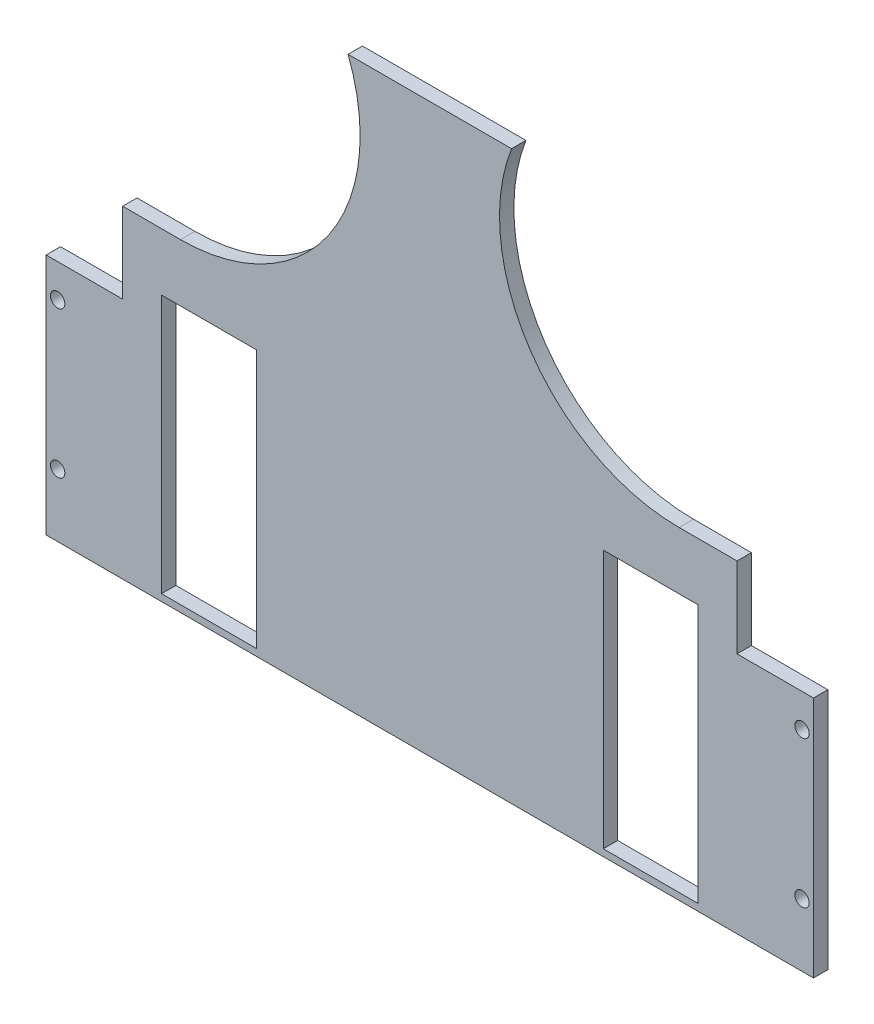
ISO-10303-21;
HEADER;
FILE_DESCRIPTION(('STEP AP214'),'2;1');
FILE_NAME('part.step','',(''),(''),'','','');
FILE_SCHEMA(('AUTOMOTIVE_DESIGN { 1 0 10303 214 1 1 1 1 }'));
ENDSEC;
DATA;
#1=APPLICATION_CONTEXT('core data for automotive mechanical design processes');
#2=APPLICATION_PROTOCOL_DEFINITION('international standard','automotive_design',2000,#1);
#3=PRODUCT_CONTEXT('',#1,'mechanical');
#4=PRODUCT('Part','Part','',(#3));
#5=PRODUCT_RELATED_PRODUCT_CATEGORY('part','',(#4));
#6=PRODUCT_DEFINITION_FORMATION('','',#4);
#7=PRODUCT_DEFINITION_CONTEXT('part definition',#1,'design');
#8=PRODUCT_DEFINITION('design','',#6,#7);
#9=PRODUCT_DEFINITION_SHAPE('','',#8);
#10=(LENGTH_UNIT() NAMED_UNIT(*) SI_UNIT(.MILLI.,.METRE.));
#11=(NAMED_UNIT(*) PLANE_ANGLE_UNIT() SI_UNIT($,.RADIAN.));
#12=(NAMED_UNIT(*) SI_UNIT($,.STERADIAN.) SOLID_ANGLE_UNIT());
#13=UNCERTAINTY_MEASURE_WITH_UNIT(LENGTH_MEASURE(1.E-05),#10,'distance_accuracy_value','');
#14=(GEOMETRIC_REPRESENTATION_CONTEXT(3) GLOBAL_UNCERTAINTY_ASSIGNED_CONTEXT((#13)) GLOBAL_UNIT_ASSIGNED_CONTEXT((#10,
#11,#12)) REPRESENTATION_CONTEXT('',''));
#15=CARTESIAN_POINT('',(0.,0.,0.));
#16=DIRECTION('',(0.,0.,1.));
#17=DIRECTION('',(1.,0.,0.));
#18=AXIS2_PLACEMENT_3D('',#15,#16,#17);
#19=CARTESIAN_POINT('',(0.,0.,5.));
#20=DIRECTION('',(0.,0.,1.));
#21=DIRECTION('',(1.,0.,0.));
#22=AXIS2_PLACEMENT_3D('',#19,#20,#21);
#23=PLANE('',#22);
#24=DIRECTION('',(1.,0.,0.));
#25=VECTOR('',#24,1.);
#26=CARTESIAN_POINT('',(-1220.60000000002,-182.000000000016,5.));
#27=LINE('',#26,#25);
#28=CARTESIAN_POINT('',(-1220.60000000002,-182.000000000016,5.));
#29=VERTEX_POINT('',#28);
#30=CARTESIAN_POINT('',(-1193.99566164199,-182.000000000016,5.));
#31=VERTEX_POINT('',#30);
#32=EDGE_CURVE('E336',#29,#31,#27,.T.);
#33=ORIENTED_EDGE('',*,*,#32,.F.);
#34=DIRECTION('',(0.,-1.,0.));
#35=VECTOR('',#34,1.);
#36=CARTESIAN_POINT('',(-1220.60000000002,-69.0000000000159,5.));
#37=LINE('',#36,#35);
#38=CARTESIAN_POINT('',(-1220.60000000002,-266.375602835039,5.));
#39=VERTEX_POINT('',#38);
#40=EDGE_CURVE('E202',#29,#39,#37,.T.);
#41=ORIENTED_EDGE('',*,*,#40,.T.);
#42=DIRECTION('',(-1.,0.,0.));
#43=VECTOR('',#42,1.);
#44=CARTESIAN_POINT('',(-1220.60000000002,-266.375602835039,5.));
#45=LINE('',#44,#43);
#46=CARTESIAN_POINT('',(-953.600000000017,-266.375602835039,5.));
#47=VERTEX_POINT('',#46);
#48=EDGE_CURVE('E173',#47,#39,#45,.T.);
#49=ORIENTED_EDGE('',*,*,#48,.F.);
#50=DIRECTION('',(0.,1.,0.));
#51=VECTOR('',#50,1.);
#52=CARTESIAN_POINT('',(-953.600000000017,-69.0000000000159,5.));
#53=LINE('',#52,#51);
#54=CARTESIAN_POINT('',(-953.600000000017,-182.000000000016,5.));
#55=VERTEX_POINT('',#54);
#56=EDGE_CURVE('E42',#47,#55,#53,.T.);
#57=ORIENTED_EDGE('',*,*,#56,.T.);
#58=DIRECTION('',(1.,0.,0.));
#59=VECTOR('',#58,1.);
#60=CARTESIAN_POINT('',(-953.600000000017,-182.000000000016,5.));
#61=LINE('',#60,#59);
#62=CARTESIAN_POINT('',(-980.204338358043,-182.000000000016,5.));
#63=VERTEX_POINT('',#62);
#64=EDGE_CURVE('E298',#63,#55,#61,.T.);
#65=ORIENTED_EDGE('',*,*,#64,.F.);
#66=DIRECTION('',(0.,-1.,0.));
#67=VECTOR('',#66,1.);
#68=CARTESIAN_POINT('',(-980.204338358043,-182.000000000016,5.));
#69=LINE('',#68,#67);
#70=CARTESIAN_POINT('',(-980.204338358043,-154.000000000016,5.));
#71=VERTEX_POINT('',#70);
#72=EDGE_CURVE('E301',#71,#63,#69,.T.);
#73=ORIENTED_EDGE('',*,*,#72,.F.);
#74=DIRECTION('',(1.,0.,0.));
#75=VECTOR('',#74,1.);
#76=CARTESIAN_POINT('',(-980.204338358043,-154.000000000016,5.));
#77=LINE('',#76,#75);
#78=CARTESIAN_POINT('',(-1000.35039250811,-154.000000000016,5.));
#79=VERTEX_POINT('',#78);
#80=EDGE_CURVE('E304',#79,#71,#77,.T.);
#81=ORIENTED_EDGE('',*,*,#80,.F.);
#82=CARTESIAN_POINT('',(-1000.35039250811,-91.5000000000158,5.));
#83=DIRECTION('',(0.,0.,1.));
#84=DIRECTION('',(-1.,0.,0.));
#85=AXIS2_PLACEMENT_3D('',#82,#83,#84);
#86=CIRCLE('',#85,62.5);
#87=CARTESIAN_POINT('',(-1058.65991145656,-69.0000000000159,5.));
#88=VERTEX_POINT('',#87);
#89=EDGE_CURVE('E178',#88,#79,#86,.T.);
#90=ORIENTED_EDGE('',*,*,#89,.F.);
#91=DIRECTION('',(-1.,0.,0.));
#92=VECTOR('',#91,1.);
#93=CARTESIAN_POINT('',(-1220.60000000002,-69.0000000000159,5.));
#94=LINE('',#93,#92);
#95=CARTESIAN_POINT('',(-1115.54008854347,-69.0000000000159,5.));
#96=VERTEX_POINT('',#95);
#97=EDGE_CURVE('E11',#88,#96,#94,.T.);
#98=ORIENTED_EDGE('',*,*,#97,.T.);
#99=CARTESIAN_POINT('',(-1173.84960749192,-91.5000000000159,5.));
#100=DIRECTION('',(0.,0.,1.));
#101=DIRECTION('',(1.,0.,0.));
#102=AXIS2_PLACEMENT_3D('',#99,#100,#101);
#103=CIRCLE('',#102,62.5);
#104=CARTESIAN_POINT('',(-1173.84960749192,-154.000000000016,5.));
#105=VERTEX_POINT('',#104);
#106=EDGE_CURVE('E58',#105,#96,#103,.T.);
#107=ORIENTED_EDGE('',*,*,#106,.F.);
#108=DIRECTION('',(1.,0.,0.));
#109=VECTOR('',#108,1.);
#110=CARTESIAN_POINT('',(-1193.99566164199,-154.000000000016,5.));
#111=LINE('',#110,#109);
#112=CARTESIAN_POINT('',(-1193.99566164199,-154.000000000016,5.));
#113=VERTEX_POINT('',#112);
#114=EDGE_CURVE('E330',#113,#105,#111,.T.);
#115=ORIENTED_EDGE('',*,*,#114,.F.);
#116=DIRECTION('',(0.,1.,0.));
#117=VECTOR('',#116,1.);
#118=CARTESIAN_POINT('',(-1193.99566164199,-182.000000000016,5.));
#119=LINE('',#118,#117);
#120=EDGE_CURVE('E333',#31,#113,#119,.T.);
#121=ORIENTED_EDGE('',*,*,#120,.F.);
#122=EDGE_LOOP('',(#33,#41,#49,#57,#65,#73,#81,#90,#98,#107,#115,#121));
#123=FACE_BOUND('',#122,.T.);
#124=CARTESIAN_POINT('',(-1216.60000000002,-244.500000000016,5.));
#125=DIRECTION('',(0.,0.,1.));
#126=DIRECTION('',(-1.,0.,0.));
#127=AXIS2_PLACEMENT_3D('',#124,#125,#126);
#128=CIRCLE('',#127,2.49999999999991);
#129=CARTESIAN_POINT('',(-1219.10000000002,-244.500000000016,5.));
#130=VERTEX_POINT('',#129);
#131=EDGE_CURVE('E241',#130,#130,#128,.T.);
#132=ORIENTED_EDGE('',*,*,#131,.F.);
#133=EDGE_LOOP('',(#132));
#134=FACE_BOUND('',#133,.T.);
#135=CARTESIAN_POINT('',(-957.600000000017,-193.500000000016,5.));
#136=DIRECTION('',(0.,0.,1.));
#137=DIRECTION('',(1.,0.,0.));
#138=AXIS2_PLACEMENT_3D('',#135,#136,#137);
#139=CIRCLE('',#138,2.50000000000003);
#140=CARTESIAN_POINT('',(-955.100000000017,-193.500000000016,5.));
#141=VERTEX_POINT('',#140);
#142=EDGE_CURVE('E224',#141,#141,#139,.T.);
#143=ORIENTED_EDGE('',*,*,#142,.F.);
#144=EDGE_LOOP('',(#143));
#145=FACE_BOUND('',#144,.T.);
#146=DIRECTION('',(1.,0.,0.));
#147=VECTOR('',#146,1.);
#148=CARTESIAN_POINT('',(-1026.74000000002,-264.000000000016,5.));
#149=LINE('',#148,#147);
#150=CARTESIAN_POINT('',(-1026.74000000002,-264.000000000016,5.));
#151=VERTEX_POINT('',#150);
#152=CARTESIAN_POINT('',(-993.740000000017,-264.000000000016,5.));
#153=VERTEX_POINT('',#152);
#154=EDGE_CURVE('E229',#151,#153,#149,.T.);
#155=ORIENTED_EDGE('',*,*,#154,.F.);
#156=DIRECTION('',(0.,-1.,0.));
#157=VECTOR('',#156,1.);
#158=CARTESIAN_POINT('',(-1026.74000000002,-174.000000000016,5.));
#159=LINE('',#158,#157);
#160=CARTESIAN_POINT('',(-1026.74000000002,-174.000000000016,5.));
#161=VERTEX_POINT('',#160);
#162=EDGE_CURVE('E214',#161,#151,#159,.T.);
#163=ORIENTED_EDGE('',*,*,#162,.F.);
#164=DIRECTION('',(-1.,0.,0.));
#165=VECTOR('',#164,1.);
#166=CARTESIAN_POINT('',(-1026.74000000002,-174.000000000016,5.));
#167=LINE('',#166,#165);
#168=CARTESIAN_POINT('',(-993.740000000017,-174.000000000016,5.));
#169=VERTEX_POINT('',#168);
#170=EDGE_CURVE('E210',#169,#161,#167,.T.);
#171=ORIENTED_EDGE('',*,*,#170,.F.);
#172=DIRECTION('',(0.,1.,0.));
#173=VECTOR('',#172,1.);
#174=CARTESIAN_POINT('',(-993.740000000017,-174.000000000016,5.));
#175=LINE('',#174,#173);
#176=EDGE_CURVE('E226',#153,#169,#175,.T.);
#177=ORIENTED_EDGE('',*,*,#176,.F.);
#178=EDGE_LOOP('',(#155,#163,#171,#177));
#179=FACE_BOUND('',#178,.T.);
#180=CARTESIAN_POINT('',(-957.600000000017,-244.500000000016,5.));
#181=DIRECTION('',(0.,0.,1.));
#182=DIRECTION('',(1.,0.,0.));
#183=AXIS2_PLACEMENT_3D('',#180,#181,#182);
#184=CIRCLE('',#183,2.50000000000003);
#185=CARTESIAN_POINT('',(-955.100000000017,-244.500000000016,5.));
#186=VERTEX_POINT('',#185);
#187=EDGE_CURVE('E235',#186,#186,#184,.T.);
#188=ORIENTED_EDGE('',*,*,#187,.F.);
#189=EDGE_LOOP('',(#188));
#190=FACE_BOUND('',#189,.T.);
#191=CARTESIAN_POINT('',(-1216.60000000002,-193.500000000016,5.));
#192=DIRECTION('',(0.,0.,1.));
#193=DIRECTION('',(-1.,0.,0.));
#194=AXIS2_PLACEMENT_3D('',#191,#192,#193);
#195=CIRCLE('',#194,2.49999999999991);
#196=CARTESIAN_POINT('',(-1219.10000000002,-193.500000000016,5.));
#197=VERTEX_POINT('',#196);
#198=EDGE_CURVE('E247',#197,#197,#195,.T.);
#199=ORIENTED_EDGE('',*,*,#198,.F.);
#200=EDGE_LOOP('',(#199));
#201=FACE_BOUND('',#200,.T.);
#202=DIRECTION('',(0.,-1.,0.));
#203=VECTOR('',#202,1.);
#204=CARTESIAN_POINT('',(-1180.46000000002,-174.000000000016,5.));
#205=LINE('',#204,#203);
#206=CARTESIAN_POINT('',(-1180.46000000002,-174.000000000016,5.));
#207=VERTEX_POINT('',#206);
#208=CARTESIAN_POINT('',(-1180.46000000002,-264.000000000016,5.));
#209=VERTEX_POINT('',#208);
#210=EDGE_CURVE('E284',#207,#209,#205,.T.);
#211=ORIENTED_EDGE('',*,*,#210,.F.);
#212=DIRECTION('',(-1.,0.,0.));
#213=VECTOR('',#212,1.);
#214=CARTESIAN_POINT('',(-1147.46000000002,-174.000000000016,5.));
#215=LINE('',#214,#213);
#216=CARTESIAN_POINT('',(-1147.46000000002,-174.000000000016,5.));
#217=VERTEX_POINT('',#216);
#218=EDGE_CURVE('E269',#217,#207,#215,.T.);
#219=ORIENTED_EDGE('',*,*,#218,.F.);
#220=DIRECTION('',(0.,1.,0.));
#221=VECTOR('',#220,1.);
#222=CARTESIAN_POINT('',(-1147.46000000002,-174.000000000016,5.));
#223=LINE('',#222,#221);
#224=CARTESIAN_POINT('',(-1147.46000000002,-264.000000000016,5.));
#225=VERTEX_POINT('',#224);
#226=EDGE_CURVE('E265',#225,#217,#223,.T.);
#227=ORIENTED_EDGE('',*,*,#226,.F.);
#228=DIRECTION('',(1.,0.,0.));
#229=VECTOR('',#228,1.);
#230=CARTESIAN_POINT('',(-1147.46000000002,-264.000000000016,5.));
#231=LINE('',#230,#229);
#232=EDGE_CURVE('E281',#209,#225,#231,.T.);
#233=ORIENTED_EDGE('',*,*,#232,.F.);
#234=EDGE_LOOP('',(#211,#219,#227,#233));
#235=FACE_BOUND('',#234,.T.);
#236=ADVANCED_FACE('F33',(#123,#134,#145,#179,#190,#201,#235),#23,.T.);
#237=CARTESIAN_POINT('',(0.,0.,0.));
#238=DIRECTION('',(0.,0.,1.));
#239=DIRECTION('',(1.,0.,0.));
#240=AXIS2_PLACEMENT_3D('',#237,#238,#239);
#241=PLANE('',#240);
#242=DIRECTION('',(0.,-1.,0.));
#243=VECTOR('',#242,1.);
#244=CARTESIAN_POINT('',(-1220.60000000002,-69.0000000000159,0.));
#245=LINE('',#244,#243);
#246=CARTESIAN_POINT('',(-1220.60000000002,-182.000000000016,0.));
#247=VERTEX_POINT('',#246);
#248=CARTESIAN_POINT('',(-1220.60000000002,-266.375602835039,0.));
#249=VERTEX_POINT('',#248);
#250=EDGE_CURVE('E187',#247,#249,#245,.T.);
#251=ORIENTED_EDGE('',*,*,#250,.F.);
#252=DIRECTION('',(1.,0.,0.));
#253=VECTOR('',#252,1.);
#254=CARTESIAN_POINT('',(-1220.60000000002,-182.000000000016,0.));
#255=LINE('',#254,#253);
#256=CARTESIAN_POINT('',(-1193.99566164199,-182.000000000016,0.));
#257=VERTEX_POINT('',#256);
#258=EDGE_CURVE('E329',#247,#257,#255,.T.);
#259=ORIENTED_EDGE('',*,*,#258,.T.);
#260=DIRECTION('',(0.,1.,0.));
#261=VECTOR('',#260,1.);
#262=CARTESIAN_POINT('',(-1193.99566164199,-182.000000000016,0.));
#263=LINE('',#262,#261);
#264=CARTESIAN_POINT('',(-1193.99566164199,-154.000000000016,0.));
#265=VERTEX_POINT('',#264);
#266=EDGE_CURVE('E344',#257,#265,#263,.T.);
#267=ORIENTED_EDGE('',*,*,#266,.T.);
#268=DIRECTION('',(1.,0.,0.));
#269=VECTOR('',#268,1.);
#270=CARTESIAN_POINT('',(-1193.99566164199,-154.000000000016,0.));
#271=LINE('',#270,#269);
#272=CARTESIAN_POINT('',(-1173.84960749192,-154.000000000016,0.));
#273=VERTEX_POINT('',#272);
#274=EDGE_CURVE('E341',#265,#273,#271,.T.);
#275=ORIENTED_EDGE('',*,*,#274,.T.);
#276=CARTESIAN_POINT('',(-1173.84960749192,-91.5000000000159,0.));
#277=DIRECTION('',(0.,0.,1.));
#278=DIRECTION('',(1.,0.,0.));
#279=AXIS2_PLACEMENT_3D('',#276,#277,#278);
#280=CIRCLE('',#279,62.5);
#281=CARTESIAN_POINT('',(-1115.54008854347,-69.0000000000159,0.));
#282=VERTEX_POINT('',#281);
#283=EDGE_CURVE('E321',#273,#282,#280,.T.);
#284=ORIENTED_EDGE('',*,*,#283,.T.);
#285=DIRECTION('',(-1.,0.,0.));
#286=VECTOR('',#285,1.);
#287=CARTESIAN_POINT('',(-1220.60000000002,-69.0000000000159,0.));
#288=LINE('',#287,#286);
#289=CARTESIAN_POINT('',(-1058.65991145656,-69.0000000000159,0.));
#290=VERTEX_POINT('',#289);
#291=EDGE_CURVE('E37',#290,#282,#288,.T.);
#292=ORIENTED_EDGE('',*,*,#291,.F.);
#293=CARTESIAN_POINT('',(-1000.35039250811,-91.5000000000158,0.));
#294=DIRECTION('',(0.,0.,1.));
#295=DIRECTION('',(-1.,0.,0.));
#296=AXIS2_PLACEMENT_3D('',#293,#294,#295);
#297=CIRCLE('',#296,62.5);
#298=CARTESIAN_POINT('',(-1000.35039250811,-154.000000000016,0.));
#299=VERTEX_POINT('',#298);
#300=EDGE_CURVE('E300',#290,#299,#297,.T.);
#301=ORIENTED_EDGE('',*,*,#300,.T.);
#302=DIRECTION('',(1.,0.,0.));
#303=VECTOR('',#302,1.);
#304=CARTESIAN_POINT('',(-980.204338358043,-154.000000000016,0.));
#305=LINE('',#304,#303);
#306=CARTESIAN_POINT('',(-980.204338358043,-154.000000000016,0.));
#307=VERTEX_POINT('',#306);
#308=EDGE_CURVE('E313',#299,#307,#305,.T.);
#309=ORIENTED_EDGE('',*,*,#308,.T.);
#310=DIRECTION('',(0.,-1.,0.));
#311=VECTOR('',#310,1.);
#312=CARTESIAN_POINT('',(-980.204338358043,-182.000000000016,0.));
#313=LINE('',#312,#311);
#314=CARTESIAN_POINT('',(-980.204338358043,-182.000000000016,0.));
#315=VERTEX_POINT('',#314);
#316=EDGE_CURVE('E310',#307,#315,#313,.T.);
#317=ORIENTED_EDGE('',*,*,#316,.T.);
#318=DIRECTION('',(1.,0.,0.));
#319=VECTOR('',#318,1.);
#320=CARTESIAN_POINT('',(-953.600000000017,-182.000000000016,0.));
#321=LINE('',#320,#319);
#322=CARTESIAN_POINT('',(-953.600000000017,-182.000000000016,0.));
#323=VERTEX_POINT('',#322);
#324=EDGE_CURVE('E290',#315,#323,#321,.T.);
#325=ORIENTED_EDGE('',*,*,#324,.T.);
#326=DIRECTION('',(0.,1.,0.));
#327=VECTOR('',#326,1.);
#328=CARTESIAN_POINT('',(-953.600000000017,-69.0000000000159,0.));
#329=LINE('',#328,#327);
#330=CARTESIAN_POINT('',(-953.600000000017,-266.375602835039,0.));
#331=VERTEX_POINT('',#330);
#332=EDGE_CURVE('E190',#331,#323,#329,.T.);
#333=ORIENTED_EDGE('',*,*,#332,.F.);
#334=DIRECTION('',(-1.,0.,0.));
#335=VECTOR('',#334,1.);
#336=CARTESIAN_POINT('',(-1220.60000000002,-266.375602835039,0.));
#337=LINE('',#336,#335);
#338=EDGE_CURVE('E50',#331,#249,#337,.T.);
#339=ORIENTED_EDGE('',*,*,#338,.T.);
#340=EDGE_LOOP('',(#251,#259,#267,#275,#284,#292,#301,#309,#317,#325,#333,#339));
#341=FACE_BOUND('',#340,.T.);
#342=CARTESIAN_POINT('',(-1216.60000000002,-193.500000000016,0.));
#343=DIRECTION('',(0.,0.,1.));
#344=DIRECTION('',(-1.,0.,0.));
#345=AXIS2_PLACEMENT_3D('',#342,#343,#344);
#346=CIRCLE('',#345,2.49999999999991);
#347=CARTESIAN_POINT('',(-1219.10000000002,-193.500000000016,0.));
#348=VERTEX_POINT('',#347);
#349=EDGE_CURVE('E250',#348,#348,#346,.T.);
#350=ORIENTED_EDGE('',*,*,#349,.T.);
#351=EDGE_LOOP('',(#350));
#352=FACE_BOUND('',#351,.T.);
#353=CARTESIAN_POINT('',(-1216.60000000002,-244.500000000016,0.));
#354=DIRECTION('',(0.,0.,1.));
#355=DIRECTION('',(-1.,0.,0.));
#356=AXIS2_PLACEMENT_3D('',#353,#354,#355);
#357=CIRCLE('',#356,2.49999999999991);
#358=CARTESIAN_POINT('',(-1219.10000000002,-244.500000000016,0.));
#359=VERTEX_POINT('',#358);
#360=EDGE_CURVE('E244',#359,#359,#357,.T.);
#361=ORIENTED_EDGE('',*,*,#360,.T.);
#362=EDGE_LOOP('',(#361));
#363=FACE_BOUND('',#362,.T.);
#364=CARTESIAN_POINT('',(-957.600000000017,-244.500000000016,0.));
#365=DIRECTION('',(0.,0.,1.));
#366=DIRECTION('',(1.,0.,0.));
#367=AXIS2_PLACEMENT_3D('',#364,#365,#366);
#368=CIRCLE('',#367,2.50000000000003);
#369=CARTESIAN_POINT('',(-955.100000000017,-244.500000000016,0.));
#370=VERTEX_POINT('',#369);
#371=EDGE_CURVE('E238',#370,#370,#368,.T.);
#372=ORIENTED_EDGE('',*,*,#371,.T.);
#373=EDGE_LOOP('',(#372));
#374=FACE_BOUND('',#373,.T.);
#375=CARTESIAN_POINT('',(-957.600000000017,-193.500000000016,0.));
#376=DIRECTION('',(0.,0.,1.));
#377=DIRECTION('',(1.,0.,0.));
#378=AXIS2_PLACEMENT_3D('',#375,#376,#377);
#379=CIRCLE('',#378,2.50000000000003);
#380=CARTESIAN_POINT('',(-955.100000000017,-193.500000000016,0.));
#381=VERTEX_POINT('',#380);
#382=EDGE_CURVE('E232',#381,#381,#379,.T.);
#383=ORIENTED_EDGE('',*,*,#382,.T.);
#384=EDGE_LOOP('',(#383));
#385=FACE_BOUND('',#384,.T.);
#386=DIRECTION('',(0.,-1.,0.));
#387=VECTOR('',#386,1.);
#388=CARTESIAN_POINT('',(-1026.74000000002,-174.000000000016,0.));
#389=LINE('',#388,#387);
#390=CARTESIAN_POINT('',(-1026.74000000002,-174.000000000016,0.));
#391=VERTEX_POINT('',#390);
#392=CARTESIAN_POINT('',(-1026.74000000002,-264.000000000016,0.));
#393=VERTEX_POINT('',#392);
#394=EDGE_CURVE('E221',#391,#393,#389,.T.);
#395=ORIENTED_EDGE('',*,*,#394,.T.);
#396=DIRECTION('',(1.,0.,0.));
#397=VECTOR('',#396,1.);
#398=CARTESIAN_POINT('',(-1026.74000000002,-264.000000000016,0.));
#399=LINE('',#398,#397);
#400=CARTESIAN_POINT('',(-993.740000000017,-264.000000000016,0.));
#401=VERTEX_POINT('',#400);
#402=EDGE_CURVE('E218',#393,#401,#399,.T.);
#403=ORIENTED_EDGE('',*,*,#402,.T.);
#404=DIRECTION('',(0.,1.,0.));
#405=VECTOR('',#404,1.);
#406=CARTESIAN_POINT('',(-993.740000000017,-174.000000000016,0.));
#407=LINE('',#406,#405);
#408=CARTESIAN_POINT('',(-993.740000000017,-174.000000000016,0.));
#409=VERTEX_POINT('',#408);
#410=EDGE_CURVE('E215',#401,#409,#407,.T.);
#411=ORIENTED_EDGE('',*,*,#410,.T.);
#412=DIRECTION('',(-1.,0.,0.));
#413=VECTOR('',#412,1.);
#414=CARTESIAN_POINT('',(-1026.74000000002,-174.000000000016,0.));
#415=LINE('',#414,#413);
#416=EDGE_CURVE('E211',#409,#391,#415,.T.);
#417=ORIENTED_EDGE('',*,*,#416,.T.);
#418=EDGE_LOOP('',(#395,#403,#411,#417));
#419=FACE_BOUND('',#418,.T.);
#420=DIRECTION('',(-1.,0.,0.));
#421=VECTOR('',#420,1.);
#422=CARTESIAN_POINT('',(-1147.46000000002,-174.000000000016,0.));
#423=LINE('',#422,#421);
#424=CARTESIAN_POINT('',(-1147.46000000002,-174.000000000016,0.));
#425=VERTEX_POINT('',#424);
#426=CARTESIAN_POINT('',(-1180.46000000002,-174.000000000016,0.));
#427=VERTEX_POINT('',#426);
#428=EDGE_CURVE('E276',#425,#427,#423,.T.);
#429=ORIENTED_EDGE('',*,*,#428,.T.);
#430=DIRECTION('',(0.,-1.,0.));
#431=VECTOR('',#430,1.);
#432=CARTESIAN_POINT('',(-1180.46000000002,-174.000000000016,0.));
#433=LINE('',#432,#431);
#434=CARTESIAN_POINT('',(-1180.46000000002,-264.000000000016,0.));
#435=VERTEX_POINT('',#434);
#436=EDGE_CURVE('E273',#427,#435,#433,.T.);
#437=ORIENTED_EDGE('',*,*,#436,.T.);
#438=DIRECTION('',(1.,0.,0.));
#439=VECTOR('',#438,1.);
#440=CARTESIAN_POINT('',(-1147.46000000002,-264.000000000016,0.));
#441=LINE('',#440,#439);
#442=CARTESIAN_POINT('',(-1147.46000000002,-264.000000000016,0.));
#443=VERTEX_POINT('',#442);
#444=EDGE_CURVE('E270',#435,#443,#441,.T.);
#445=ORIENTED_EDGE('',*,*,#444,.T.);
#446=DIRECTION('',(0.,1.,0.));
#447=VECTOR('',#446,1.);
#448=CARTESIAN_POINT('',(-1147.46000000002,-174.000000000016,0.));
#449=LINE('',#448,#447);
#450=EDGE_CURVE('E266',#443,#425,#449,.T.);
#451=ORIENTED_EDGE('',*,*,#450,.T.);
#452=EDGE_LOOP('',(#429,#437,#445,#451));
#453=FACE_BOUND('',#452,.T.);
#454=ADVANCED_FACE('F184',(#341,#352,#363,#374,#385,#419,#453),#241,.F.);
#455=CARTESIAN_POINT('',(-1220.60000000002,-69.0000000000159,5.));
#456=DIRECTION('',(1.,0.,0.));
#457=DIRECTION('',(0.,0.,-1.));
#458=AXIS2_PLACEMENT_3D('',#455,#456,#457);
#459=PLANE('',#458);
#460=ORIENTED_EDGE('',*,*,#40,.F.);
#461=DIRECTION('',(0.,0.,1.));
#462=VECTOR('',#461,1.);
#463=CARTESIAN_POINT('',(-1220.60000000002,-182.000000000016,0.));
#464=LINE('',#463,#462);
#465=EDGE_CURVE('E193',#247,#29,#464,.T.);
#466=ORIENTED_EDGE('',*,*,#465,.F.);
#467=ORIENTED_EDGE('',*,*,#250,.T.);
#468=DIRECTION('',(0.,0.,1.));
#469=VECTOR('',#468,1.);
#470=CARTESIAN_POINT('',(-1220.60000000002,-266.375602835039,0.));
#471=LINE('',#470,#469);
#472=EDGE_CURVE('E170',#249,#39,#471,.T.);
#473=ORIENTED_EDGE('',*,*,#472,.T.);
#474=EDGE_LOOP('',(#460,#466,#467,#473));
#475=FACE_BOUND('',#474,.T.);
#476=ADVANCED_FACE('F35',(#475),#459,.F.);
#477=CARTESIAN_POINT('',(-953.600000000017,-69.0000000000159,5.));
#478=DIRECTION('',(-1.,0.,0.));
#479=DIRECTION('',(0.,0.,1.));
#480=AXIS2_PLACEMENT_3D('',#477,#478,#479);
#481=PLANE('',#480);
#482=ORIENTED_EDGE('',*,*,#56,.F.);
#483=DIRECTION('',(0.,0.,1.));
#484=VECTOR('',#483,1.);
#485=CARTESIAN_POINT('',(-953.600000000017,-266.375602835039,0.));
#486=LINE('',#485,#484);
#487=EDGE_CURVE('E179',#331,#47,#486,.T.);
#488=ORIENTED_EDGE('',*,*,#487,.F.);
#489=ORIENTED_EDGE('',*,*,#332,.T.);
#490=DIRECTION('',(0.,0.,1.));
#491=VECTOR('',#490,1.);
#492=CARTESIAN_POINT('',(-953.600000000017,-182.000000000016,0.));
#493=LINE('',#492,#491);
#494=EDGE_CURVE('E294',#323,#55,#493,.T.);
#495=ORIENTED_EDGE('',*,*,#494,.T.);
#496=EDGE_LOOP('',(#482,#488,#489,#495));
#497=FACE_BOUND('',#496,.T.);
#498=ADVANCED_FACE('F355',(#497),#481,.F.);
#499=CARTESIAN_POINT('',(-1220.60000000002,-69.0000000000159,5.));
#500=DIRECTION('',(0.,-1.,0.));
#501=DIRECTION('',(1.,0.,0.));
#502=AXIS2_PLACEMENT_3D('',#499,#500,#501);
#503=PLANE('',#502);
#504=ORIENTED_EDGE('',*,*,#291,.T.);
#505=DIRECTION('',(0.,0.,1.));
#506=VECTOR('',#505,1.);
#507=CARTESIAN_POINT('',(-1115.54008854347,-69.0000000000159,0.));
#508=LINE('',#507,#506);
#509=EDGE_CURVE('E325',#282,#96,#508,.T.);
#510=ORIENTED_EDGE('',*,*,#509,.T.);
#511=ORIENTED_EDGE('',*,*,#97,.F.);
#512=DIRECTION('',(0.,0.,1.));
#513=VECTOR('',#512,1.);
#514=CARTESIAN_POINT('',(-1058.65991145656,-69.0000000000159,0.));
#515=LINE('',#514,#513);
#516=EDGE_CURVE('E279',#290,#88,#515,.T.);
#517=ORIENTED_EDGE('',*,*,#516,.F.);
#518=EDGE_LOOP('',(#504,#510,#511,#517));
#519=FACE_BOUND('',#518,.T.);
#520=ADVANCED_FACE('F375',(#519),#503,.F.);
#521=CARTESIAN_POINT('',(-1026.74000000002,-174.000000000016,5.));
#522=DIRECTION('',(1.,0.,0.));
#523=DIRECTION('',(0.,0.,-1.));
#524=AXIS2_PLACEMENT_3D('',#521,#522,#523);
#525=PLANE('',#524);
#526=ORIENTED_EDGE('',*,*,#394,.F.);
#527=DIRECTION('',(0.,0.,-1.));
#528=VECTOR('',#527,1.);
#529=CARTESIAN_POINT('',(-1026.74000000002,-174.000000000016,5.));
#530=LINE('',#529,#528);
#531=EDGE_CURVE('E207',#161,#391,#530,.T.);
#532=ORIENTED_EDGE('',*,*,#531,.F.);
#533=ORIENTED_EDGE('',*,*,#162,.T.);
#534=DIRECTION('',(0.,0.,-1.));
#535=VECTOR('',#534,1.);
#536=CARTESIAN_POINT('',(-1026.74000000002,-264.000000000016,5.));
#537=LINE('',#536,#535);
#538=EDGE_CURVE('E194',#151,#393,#537,.T.);
#539=ORIENTED_EDGE('',*,*,#538,.T.);
#540=EDGE_LOOP('',(#526,#532,#533,#539));
#541=FACE_BOUND('',#540,.T.);
#542=ADVANCED_FACE('F405',(#541),#525,.T.);
#543=CARTESIAN_POINT('',(-1026.74000000002,-264.000000000016,5.));
#544=DIRECTION('',(0.,1.,0.));
#545=DIRECTION('',(0.,0.,1.));
#546=AXIS2_PLACEMENT_3D('',#543,#544,#545);
#547=PLANE('',#546);
#548=ORIENTED_EDGE('',*,*,#402,.F.);
#549=ORIENTED_EDGE('',*,*,#538,.F.);
#550=ORIENTED_EDGE('',*,*,#154,.T.);
#551=DIRECTION('',(0.,0.,-1.));
#552=VECTOR('',#551,1.);
#553=CARTESIAN_POINT('',(-993.740000000017,-264.000000000016,5.));
#554=LINE('',#553,#552);
#555=EDGE_CURVE('E197',#153,#401,#554,.T.);
#556=ORIENTED_EDGE('',*,*,#555,.T.);
#557=EDGE_LOOP('',(#548,#549,#550,#556));
#558=FACE_BOUND('',#557,.T.);
#559=ADVANCED_FACE('F525',(#558),#547,.T.);
#560=CARTESIAN_POINT('',(-993.740000000017,-174.000000000016,5.));
#561=DIRECTION('',(-1.,0.,0.));
#562=DIRECTION('',(0.,0.,1.));
#563=AXIS2_PLACEMENT_3D('',#560,#561,#562);
#564=PLANE('',#563);
#565=ORIENTED_EDGE('',*,*,#410,.F.);
#566=ORIENTED_EDGE('',*,*,#555,.F.);
#567=ORIENTED_EDGE('',*,*,#176,.T.);
#568=DIRECTION('',(0.,0.,-1.));
#569=VECTOR('',#568,1.);
#570=CARTESIAN_POINT('',(-993.740000000017,-174.000000000016,5.));
#571=LINE('',#570,#569);
#572=EDGE_CURVE('E205',#169,#409,#571,.T.);
#573=ORIENTED_EDGE('',*,*,#572,.T.);
#574=EDGE_LOOP('',(#565,#566,#567,#573));
#575=FACE_BOUND('',#574,.T.);
#576=ADVANCED_FACE('F515',(#575),#564,.T.);
#577=CARTESIAN_POINT('',(-1026.74000000002,-174.000000000016,5.));
#578=DIRECTION('',(0.,-1.,0.));
#579=DIRECTION('',(1.,0.,0.));
#580=AXIS2_PLACEMENT_3D('',#577,#578,#579);
#581=PLANE('',#580);
#582=ORIENTED_EDGE('',*,*,#416,.F.);
#583=ORIENTED_EDGE('',*,*,#572,.F.);
#584=ORIENTED_EDGE('',*,*,#170,.T.);
#585=ORIENTED_EDGE('',*,*,#531,.T.);
#586=EDGE_LOOP('',(#582,#583,#584,#585));
#587=FACE_BOUND('',#586,.T.);
#588=ADVANCED_FACE('F505',(#587),#581,.T.);
#589=CARTESIAN_POINT('',(-957.600000000017,-193.500000000016,5.));
#590=DIRECTION('',(0.,0.,-1.));
#591=DIRECTION('',(-1.,0.,0.));
#592=AXIS2_PLACEMENT_3D('',#589,#590,#591);
#593=CYLINDRICAL_SURFACE('',#592,2.50000000000003);
#594=ORIENTED_EDGE('',*,*,#142,.T.);
#595=EDGE_LOOP('',(#594));
#596=FACE_BOUND('',#595,.T.);
#597=ORIENTED_EDGE('',*,*,#382,.F.);
#598=EDGE_LOOP('',(#597));
#599=FACE_BOUND('',#598,.T.);
#600=ADVANCED_FACE('F495',(#596,#599),#593,.F.);
#601=CARTESIAN_POINT('',(-957.600000000017,-244.500000000016,5.));
#602=DIRECTION('',(0.,0.,-1.));
#603=DIRECTION('',(-1.,0.,0.));
#604=AXIS2_PLACEMENT_3D('',#601,#602,#603);
#605=CYLINDRICAL_SURFACE('',#604,2.50000000000003);
#606=ORIENTED_EDGE('',*,*,#187,.T.);
#607=EDGE_LOOP('',(#606));
#608=FACE_BOUND('',#607,.T.);
#609=ORIENTED_EDGE('',*,*,#371,.F.);
#610=EDGE_LOOP('',(#609));
#611=FACE_BOUND('',#610,.T.);
#612=ADVANCED_FACE('F485',(#608,#611),#605,.F.);
#613=CARTESIAN_POINT('',(-1216.60000000002,-244.500000000016,5.));
#614=DIRECTION('',(0.,0.,-1.));
#615=DIRECTION('',(-1.,0.,0.));
#616=AXIS2_PLACEMENT_3D('',#613,#614,#615);
#617=CYLINDRICAL_SURFACE('',#616,2.49999999999991);
#618=ORIENTED_EDGE('',*,*,#131,.T.);
#619=EDGE_LOOP('',(#618));
#620=FACE_BOUND('',#619,.T.);
#621=ORIENTED_EDGE('',*,*,#360,.F.);
#622=EDGE_LOOP('',(#621));
#623=FACE_BOUND('',#622,.T.);
#624=ADVANCED_FACE('F475',(#620,#623),#617,.F.);
#625=CARTESIAN_POINT('',(-1216.60000000002,-193.500000000016,5.));
#626=DIRECTION('',(0.,0.,-1.));
#627=DIRECTION('',(-1.,0.,0.));
#628=AXIS2_PLACEMENT_3D('',#625,#626,#627);
#629=CYLINDRICAL_SURFACE('',#628,2.49999999999991);
#630=ORIENTED_EDGE('',*,*,#198,.T.);
#631=EDGE_LOOP('',(#630));
#632=FACE_BOUND('',#631,.T.);
#633=ORIENTED_EDGE('',*,*,#349,.F.);
#634=EDGE_LOOP('',(#633));
#635=FACE_BOUND('',#634,.T.);
#636=ADVANCED_FACE('F465',(#632,#635),#629,.F.);
#637=CARTESIAN_POINT('',(-1147.46000000002,-174.000000000016,5.));
#638=DIRECTION('',(0.,-1.,0.));
#639=DIRECTION('',(1.,0.,0.));
#640=AXIS2_PLACEMENT_3D('',#637,#638,#639);
#641=PLANE('',#640);
#642=ORIENTED_EDGE('',*,*,#428,.F.);
#643=DIRECTION('',(0.,0.,-1.));
#644=VECTOR('',#643,1.);
#645=CARTESIAN_POINT('',(-1147.46000000002,-174.000000000016,5.));
#646=LINE('',#645,#644);
#647=EDGE_CURVE('E262',#217,#425,#646,.T.);
#648=ORIENTED_EDGE('',*,*,#647,.F.);
#649=ORIENTED_EDGE('',*,*,#218,.T.);
#650=DIRECTION('',(0.,0.,-1.));
#651=VECTOR('',#650,1.);
#652=CARTESIAN_POINT('',(-1180.46000000002,-174.000000000016,5.));
#653=LINE('',#652,#651);
#654=EDGE_CURVE('E253',#207,#427,#653,.T.);
#655=ORIENTED_EDGE('',*,*,#654,.T.);
#656=EDGE_LOOP('',(#642,#648,#649,#655));
#657=FACE_BOUND('',#656,.T.);
#658=ADVANCED_FACE('F455',(#657),#641,.T.);
#659=CARTESIAN_POINT('',(-1180.46000000002,-174.000000000016,5.));
#660=DIRECTION('',(1.,0.,0.));
#661=DIRECTION('',(0.,0.,-1.));
#662=AXIS2_PLACEMENT_3D('',#659,#660,#661);
#663=PLANE('',#662);
#664=ORIENTED_EDGE('',*,*,#436,.F.);
#665=ORIENTED_EDGE('',*,*,#654,.F.);
#666=ORIENTED_EDGE('',*,*,#210,.T.);
#667=DIRECTION('',(0.,0.,-1.));
#668=VECTOR('',#667,1.);
#669=CARTESIAN_POINT('',(-1180.46000000002,-264.000000000016,5.));
#670=LINE('',#669,#668);
#671=EDGE_CURVE('E258',#209,#435,#670,.T.);
#672=ORIENTED_EDGE('',*,*,#671,.T.);
#673=EDGE_LOOP('',(#664,#665,#666,#672));
#674=FACE_BOUND('',#673,.T.);
#675=ADVANCED_FACE('F445',(#674),#663,.T.);
#676=CARTESIAN_POINT('',(-1147.46000000002,-264.000000000016,5.));
#677=DIRECTION('',(0.,1.,0.));
#678=DIRECTION('',(0.,0.,1.));
#679=AXIS2_PLACEMENT_3D('',#676,#677,#678);
#680=PLANE('',#679);
#681=ORIENTED_EDGE('',*,*,#444,.F.);
#682=ORIENTED_EDGE('',*,*,#671,.F.);
#683=ORIENTED_EDGE('',*,*,#232,.T.);
#684=DIRECTION('',(0.,0.,-1.));
#685=VECTOR('',#684,1.);
#686=CARTESIAN_POINT('',(-1147.46000000002,-264.000000000016,5.));
#687=LINE('',#686,#685);
#688=EDGE_CURVE('E260',#225,#443,#687,.T.);
#689=ORIENTED_EDGE('',*,*,#688,.T.);
#690=EDGE_LOOP('',(#681,#682,#683,#689));
#691=FACE_BOUND('',#690,.T.);
#692=ADVANCED_FACE('F433',(#691),#680,.T.);
#693=CARTESIAN_POINT('',(-1147.46000000002,-174.000000000016,5.));
#694=DIRECTION('',(-1.,0.,0.));
#695=DIRECTION('',(0.,0.,1.));
#696=AXIS2_PLACEMENT_3D('',#693,#694,#695);
#697=PLANE('',#696);
#698=ORIENTED_EDGE('',*,*,#450,.F.);
#699=ORIENTED_EDGE('',*,*,#688,.F.);
#700=ORIENTED_EDGE('',*,*,#226,.T.);
#701=ORIENTED_EDGE('',*,*,#647,.T.);
#702=EDGE_LOOP('',(#698,#699,#700,#701));
#703=FACE_BOUND('',#702,.T.);
#704=ADVANCED_FACE('F428',(#703),#697,.T.);
#705=CARTESIAN_POINT('',(-1000.35039250811,-91.5000000000158,0.));
#706=DIRECTION('',(0.,0.,1.));
#707=DIRECTION('',(1.,0.,0.));
#708=AXIS2_PLACEMENT_3D('',#705,#706,#707);
#709=CYLINDRICAL_SURFACE('',#708,62.5);
#710=ORIENTED_EDGE('',*,*,#89,.T.);
#711=DIRECTION('',(0.,0.,1.));
#712=VECTOR('',#711,1.);
#713=CARTESIAN_POINT('',(-1000.35039250811,-154.000000000016,0.));
#714=LINE('',#713,#712);
#715=EDGE_CURVE('E287',#299,#79,#714,.T.);
#716=ORIENTED_EDGE('',*,*,#715,.F.);
#717=ORIENTED_EDGE('',*,*,#300,.F.);
#718=ORIENTED_EDGE('',*,*,#516,.T.);
#719=EDGE_LOOP('',(#710,#716,#717,#718));
#720=FACE_BOUND('',#719,.T.);
#721=ADVANCED_FACE('F370',(#720),#709,.F.);
#722=CARTESIAN_POINT('',(-953.600000000017,-182.000000000016,0.));
#723=DIRECTION('',(0.,-1.,0.));
#724=DIRECTION('',(0.,0.,-1.));
#725=AXIS2_PLACEMENT_3D('',#722,#723,#724);
#726=PLANE('',#725);
#727=ORIENTED_EDGE('',*,*,#64,.T.);
#728=ORIENTED_EDGE('',*,*,#494,.F.);
#729=ORIENTED_EDGE('',*,*,#324,.F.);
#730=DIRECTION('',(0.,0.,1.));
#731=VECTOR('',#730,1.);
#732=CARTESIAN_POINT('',(-980.204338358043,-182.000000000016,0.));
#733=LINE('',#732,#731);
#734=EDGE_CURVE('E292',#315,#63,#733,.T.);
#735=ORIENTED_EDGE('',*,*,#734,.T.);
#736=EDGE_LOOP('',(#727,#728,#729,#735));
#737=FACE_BOUND('',#736,.T.);
#738=ADVANCED_FACE('F358',(#737),#726,.F.);
#739=CARTESIAN_POINT('',(-980.204338358043,-182.000000000016,0.));
#740=DIRECTION('',(-1.,0.,0.));
#741=DIRECTION('',(0.,0.,1.));
#742=AXIS2_PLACEMENT_3D('',#739,#740,#741);
#743=PLANE('',#742);
#744=ORIENTED_EDGE('',*,*,#72,.T.);
#745=ORIENTED_EDGE('',*,*,#734,.F.);
#746=ORIENTED_EDGE('',*,*,#316,.F.);
#747=DIRECTION('',(0.,0.,1.));
#748=VECTOR('',#747,1.);
#749=CARTESIAN_POINT('',(-980.204338358043,-154.000000000016,0.));
#750=LINE('',#749,#748);
#751=EDGE_CURVE('E289',#307,#71,#750,.T.);
#752=ORIENTED_EDGE('',*,*,#751,.T.);
#753=EDGE_LOOP('',(#744,#745,#746,#752));
#754=FACE_BOUND('',#753,.T.);
#755=ADVANCED_FACE('F362',(#754),#743,.F.);
#756=CARTESIAN_POINT('',(-980.204338358043,-154.000000000016,0.));
#757=DIRECTION('',(0.,-1.,0.));
#758=DIRECTION('',(0.,0.,-1.));
#759=AXIS2_PLACEMENT_3D('',#756,#757,#758);
#760=PLANE('',#759);
#761=ORIENTED_EDGE('',*,*,#80,.T.);
#762=ORIENTED_EDGE('',*,*,#751,.F.);
#763=ORIENTED_EDGE('',*,*,#308,.F.);
#764=ORIENTED_EDGE('',*,*,#715,.T.);
#765=EDGE_LOOP('',(#761,#762,#763,#764));
#766=FACE_BOUND('',#765,.T.);
#767=ADVANCED_FACE('F368',(#766),#760,.F.);
#768=CARTESIAN_POINT('',(-1220.60000000002,-182.000000000016,0.));
#769=DIRECTION('',(0.,-1.,0.));
#770=DIRECTION('',(0.,0.,-1.));
#771=AXIS2_PLACEMENT_3D('',#768,#769,#770);
#772=PLANE('',#771);
#773=ORIENTED_EDGE('',*,*,#32,.T.);
#774=DIRECTION('',(0.,0.,1.));
#775=VECTOR('',#774,1.);
#776=CARTESIAN_POINT('',(-1193.99566164199,-182.000000000016,0.));
#777=LINE('',#776,#775);
#778=EDGE_CURVE('E318',#257,#31,#777,.T.);
#779=ORIENTED_EDGE('',*,*,#778,.F.);
#780=ORIENTED_EDGE('',*,*,#258,.F.);
#781=ORIENTED_EDGE('',*,*,#465,.T.);
#782=EDGE_LOOP('',(#773,#779,#780,#781));
#783=FACE_BOUND('',#782,.T.);
#784=ADVANCED_FACE('F387',(#783),#772,.F.);
#785=CARTESIAN_POINT('',(-1173.84960749192,-91.5000000000159,0.));
#786=DIRECTION('',(0.,0.,1.));
#787=DIRECTION('',(1.,0.,0.));
#788=AXIS2_PLACEMENT_3D('',#785,#786,#787);
#789=CYLINDRICAL_SURFACE('',#788,62.5);
#790=ORIENTED_EDGE('',*,*,#106,.T.);
#791=ORIENTED_EDGE('',*,*,#509,.F.);
#792=ORIENTED_EDGE('',*,*,#283,.F.);
#793=DIRECTION('',(0.,0.,1.));
#794=VECTOR('',#793,1.);
#795=CARTESIAN_POINT('',(-1173.84960749192,-154.000000000016,0.));
#796=LINE('',#795,#794);
#797=EDGE_CURVE('E323',#273,#105,#796,.T.);
#798=ORIENTED_EDGE('',*,*,#797,.T.);
#799=EDGE_LOOP('',(#790,#791,#792,#798));
#800=FACE_BOUND('',#799,.T.);
#801=ADVANCED_FACE('F378',(#800),#789,.F.);
#802=CARTESIAN_POINT('',(-1193.99566164199,-154.000000000016,0.));
#803=DIRECTION('',(0.,-1.,0.));
#804=DIRECTION('',(0.,0.,-1.));
#805=AXIS2_PLACEMENT_3D('',#802,#803,#804);
#806=PLANE('',#805);
#807=ORIENTED_EDGE('',*,*,#114,.T.);
#808=ORIENTED_EDGE('',*,*,#797,.F.);
#809=ORIENTED_EDGE('',*,*,#274,.F.);
#810=DIRECTION('',(0.,0.,1.));
#811=VECTOR('',#810,1.);
#812=CARTESIAN_POINT('',(-1193.99566164199,-154.000000000016,0.));
#813=LINE('',#812,#811);
#814=EDGE_CURVE('E320',#265,#113,#813,.T.);
#815=ORIENTED_EDGE('',*,*,#814,.T.);
#816=EDGE_LOOP('',(#807,#808,#809,#815));
#817=FACE_BOUND('',#816,.T.);
#818=ADVANCED_FACE('F382',(#817),#806,.F.);
#819=CARTESIAN_POINT('',(-1193.99566164199,-182.000000000016,0.));
#820=DIRECTION('',(1.,0.,0.));
#821=DIRECTION('',(0.,0.,-1.));
#822=AXIS2_PLACEMENT_3D('',#819,#820,#821);
#823=PLANE('',#822);
#824=ORIENTED_EDGE('',*,*,#120,.T.);
#825=ORIENTED_EDGE('',*,*,#814,.F.);
#826=ORIENTED_EDGE('',*,*,#266,.F.);
#827=ORIENTED_EDGE('',*,*,#778,.T.);
#828=EDGE_LOOP('',(#824,#825,#826,#827));
#829=FACE_BOUND('',#828,.T.);
#830=ADVANCED_FACE('F385',(#829),#823,.F.);
#831=CARTESIAN_POINT('',(-1220.60000000002,-266.375602835039,0.));
#832=DIRECTION('',(0.,1.,0.));
#833=DIRECTION('',(0.,0.,1.));
#834=AXIS2_PLACEMENT_3D('',#831,#832,#833);
#835=PLANE('',#834);
#836=ORIENTED_EDGE('',*,*,#48,.T.);
#837=ORIENTED_EDGE('',*,*,#472,.F.);
#838=ORIENTED_EDGE('',*,*,#338,.F.);
#839=ORIENTED_EDGE('',*,*,#487,.T.);
#840=EDGE_LOOP('',(#836,#837,#838,#839));
#841=FACE_BOUND('',#840,.T.);
#842=ADVANCED_FACE('F171',(#841),#835,.F.);
#843=CLOSED_SHELL('',(#236,#454,#476,#498,#520,#542,#559,#576,#588,#600,#612,#624,#636,#658,
#675,#692,#704,#721,#738,#755,#767,#784,#801,#818,#830,#842));
#844=MANIFOLD_SOLID_BREP('B2',#843);
#845=ADVANCED_BREP_SHAPE_REPRESENTATION('',(#18,#844),#14);
#846=SHAPE_DEFINITION_REPRESENTATION(#9,#845);
ENDSEC;
END-ISO-10303-21;
